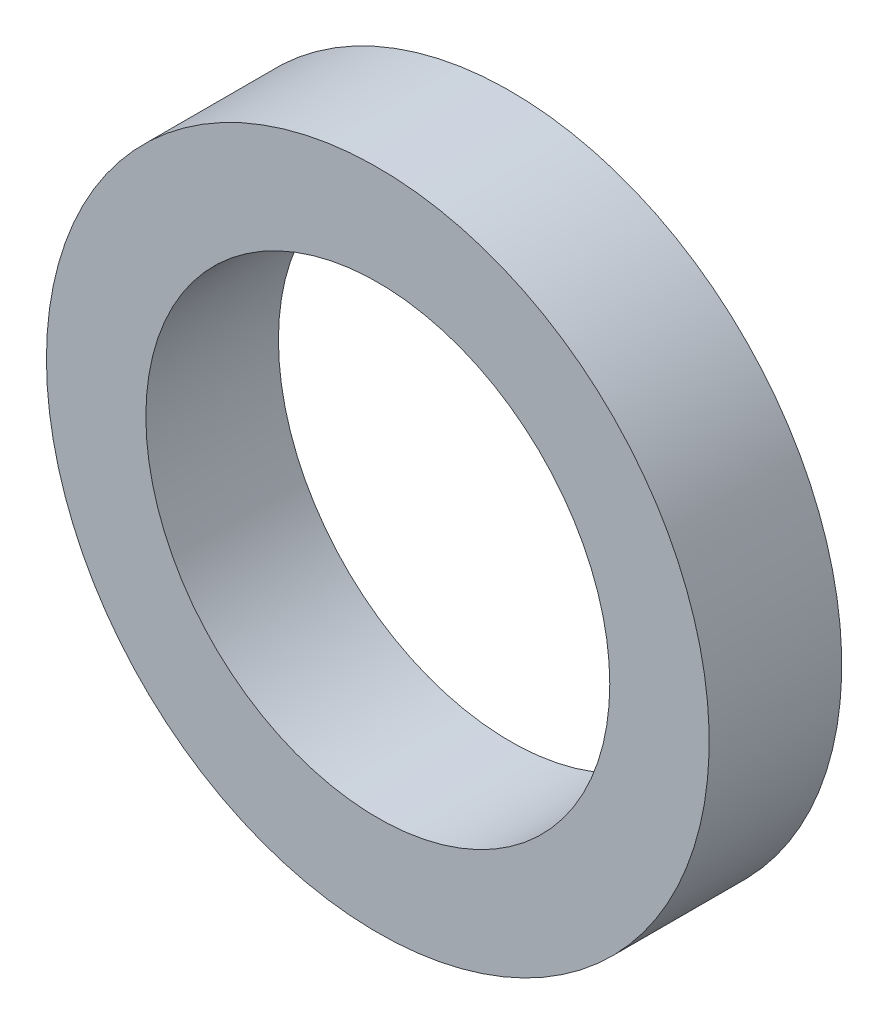
ISO-10303-21;
HEADER;
FILE_DESCRIPTION(('STEP AP214'),'2;1');
FILE_NAME('part.step','',(''),(''),'','','');
FILE_SCHEMA(('AUTOMOTIVE_DESIGN { 1 0 10303 214 1 1 1 1 }'));
ENDSEC;
DATA;
#1=APPLICATION_CONTEXT('core data for automotive mechanical design processes');
#2=APPLICATION_PROTOCOL_DEFINITION('international standard','automotive_design',2000,#1);
#3=PRODUCT_CONTEXT('',#1,'mechanical');
#4=PRODUCT('Part','Part','',(#3));
#5=PRODUCT_RELATED_PRODUCT_CATEGORY('part','',(#4));
#6=PRODUCT_DEFINITION_FORMATION('','',#4);
#7=PRODUCT_DEFINITION_CONTEXT('part definition',#1,'design');
#8=PRODUCT_DEFINITION('design','',#6,#7);
#9=PRODUCT_DEFINITION_SHAPE('','',#8);
#10=(LENGTH_UNIT() NAMED_UNIT(*) SI_UNIT(.MILLI.,.METRE.));
#11=(NAMED_UNIT(*) PLANE_ANGLE_UNIT() SI_UNIT($,.RADIAN.));
#12=(NAMED_UNIT(*) SI_UNIT($,.STERADIAN.) SOLID_ANGLE_UNIT());
#13=UNCERTAINTY_MEASURE_WITH_UNIT(LENGTH_MEASURE(1.E-05),#10,'distance_accuracy_value','');
#14=(GEOMETRIC_REPRESENTATION_CONTEXT(3) GLOBAL_UNCERTAINTY_ASSIGNED_CONTEXT((#13)) GLOBAL_UNIT_ASSIGNED_CONTEXT((#10,
#11,#12)) REPRESENTATION_CONTEXT('',''));
#15=CARTESIAN_POINT('',(0.,0.,0.));
#16=DIRECTION('',(0.,0.,1.));
#17=DIRECTION('',(1.,0.,0.));
#18=AXIS2_PLACEMENT_3D('',#15,#16,#17);
#19=CARTESIAN_POINT('',(0.,0.,-1.5875));
#20=DIRECTION('',(0.,0.,1.));
#21=DIRECTION('',(1.,0.,0.));
#22=AXIS2_PLACEMENT_3D('',#19,#20,#21);
#23=PLANE('',#22);
#24=CARTESIAN_POINT('',(0.,0.,-1.5875));
#25=DIRECTION('',(0.,0.,-1.));
#26=DIRECTION('',(-1.,0.,0.));
#27=AXIS2_PLACEMENT_3D('',#24,#25,#26);
#28=CIRCLE('',#27,5.55625);
#29=CARTESIAN_POINT('',(-5.55625,0.,-1.5875));
#30=VERTEX_POINT('',#29);
#31=EDGE_CURVE('E27',#30,#30,#28,.F.);
#32=ORIENTED_EDGE('',*,*,#31,.T.);
#33=EDGE_LOOP('',(#32));
#34=FACE_BOUND('',#33,.T.);
#35=CARTESIAN_POINT('',(0.,0.,-1.5875));
#36=DIRECTION('',(0.,0.,-1.));
#37=DIRECTION('',(-1.,0.,0.));
#38=AXIS2_PLACEMENT_3D('',#35,#36,#37);
#39=CIRCLE('',#38,7.9375);
#40=CARTESIAN_POINT('',(-7.9375,0.,-1.5875));
#41=VERTEX_POINT('',#40);
#42=EDGE_CURVE('E18',#41,#41,#39,.F.);
#43=ORIENTED_EDGE('',*,*,#42,.F.);
#44=EDGE_LOOP('',(#43));
#45=FACE_BOUND('',#44,.T.);
#46=ADVANCED_FACE('F15',(#34,#45),#23,.F.);
#47=CARTESIAN_POINT('',(0.,0.,1.5875));
#48=DIRECTION('',(0.,0.,-1.));
#49=DIRECTION('',(-1.,0.,0.));
#50=AXIS2_PLACEMENT_3D('',#47,#48,#49);
#51=CYLINDRICAL_SURFACE('',#50,7.9375);
#52=ORIENTED_EDGE('',*,*,#42,.T.);
#53=EDGE_LOOP('',(#52));
#54=FACE_BOUND('',#53,.T.);
#55=CARTESIAN_POINT('',(0.,0.,1.5875));
#56=DIRECTION('',(0.,0.,-1.));
#57=DIRECTION('',(-1.,0.,0.));
#58=AXIS2_PLACEMENT_3D('',#55,#56,#57);
#59=CIRCLE('',#58,7.9375);
#60=CARTESIAN_POINT('',(-7.9375,0.,1.5875));
#61=VERTEX_POINT('',#60);
#62=EDGE_CURVE('E22',#61,#61,#59,.F.);
#63=ORIENTED_EDGE('',*,*,#62,.F.);
#64=EDGE_LOOP('',(#63));
#65=FACE_BOUND('',#64,.T.);
#66=ADVANCED_FACE('F35',(#54,#65),#51,.T.);
#67=CARTESIAN_POINT('',(0.,0.,1.5875));
#68=DIRECTION('',(0.,0.,-1.));
#69=DIRECTION('',(-1.,0.,0.));
#70=AXIS2_PLACEMENT_3D('',#67,#68,#69);
#71=CYLINDRICAL_SURFACE('',#70,5.55625);
#72=CARTESIAN_POINT('',(0.,0.,1.5875));
#73=DIRECTION('',(0.,0.,-1.));
#74=DIRECTION('',(-1.,0.,0.));
#75=AXIS2_PLACEMENT_3D('',#72,#73,#74);
#76=CIRCLE('',#75,5.55625);
#77=CARTESIAN_POINT('',(-5.55625,0.,1.5875));
#78=VERTEX_POINT('',#77);
#79=EDGE_CURVE('E10',#78,#78,#76,.T.);
#80=ORIENTED_EDGE('',*,*,#79,.F.);
#81=EDGE_LOOP('',(#80));
#82=FACE_BOUND('',#81,.T.);
#83=ORIENTED_EDGE('',*,*,#31,.F.);
#84=EDGE_LOOP('',(#83));
#85=FACE_BOUND('',#84,.T.);
#86=ADVANCED_FACE('F43',(#82,#85),#71,.F.);
#87=CARTESIAN_POINT('',(0.,0.,1.5875));
#88=DIRECTION('',(0.,0.,1.));
#89=DIRECTION('',(1.,0.,0.));
#90=AXIS2_PLACEMENT_3D('',#87,#88,#89);
#91=PLANE('',#90);
#92=ORIENTED_EDGE('',*,*,#79,.T.);
#93=EDGE_LOOP('',(#92));
#94=FACE_BOUND('',#93,.T.);
#95=ORIENTED_EDGE('',*,*,#62,.T.);
#96=EDGE_LOOP('',(#95));
#97=FACE_BOUND('',#96,.T.);
#98=ADVANCED_FACE('F44',(#94,#97),#91,.T.);
#99=CLOSED_SHELL('',(#46,#66,#86,#98));
#100=MANIFOLD_SOLID_BREP('B1',#99);
#101=ADVANCED_BREP_SHAPE_REPRESENTATION('',(#18,#100),#14);
#102=SHAPE_DEFINITION_REPRESENTATION(#9,#101);
ENDSEC;
END-ISO-10303-21;
